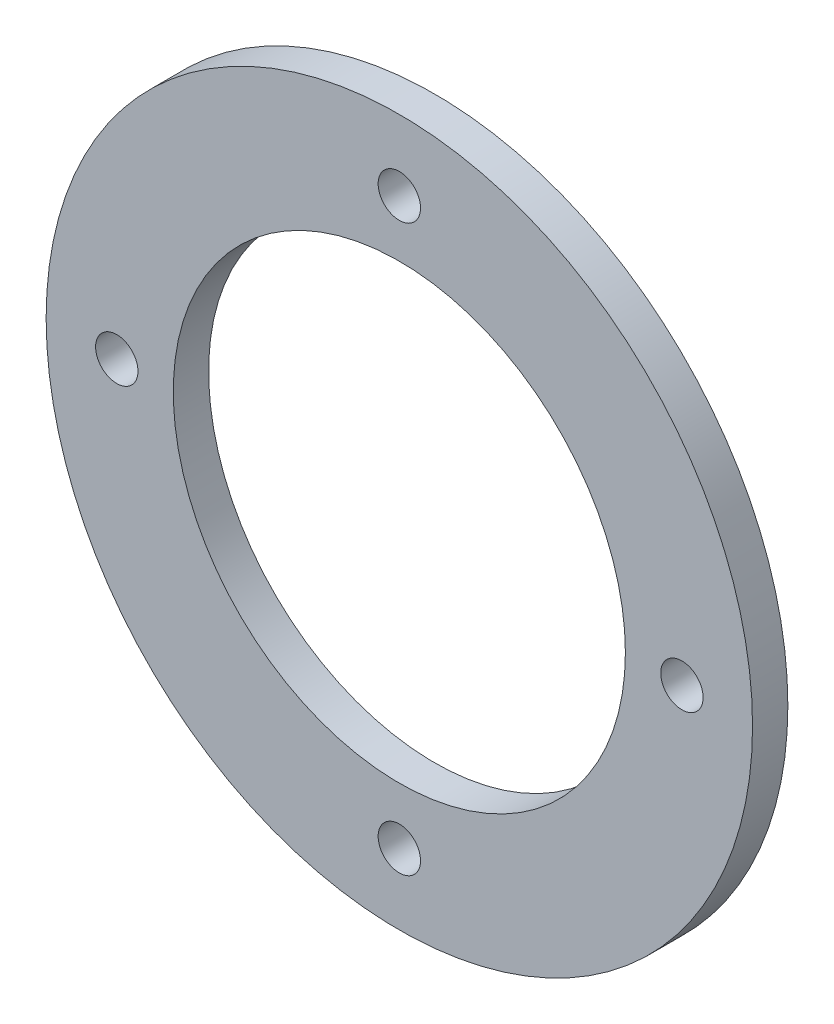
ISO-10303-21;
HEADER;
FILE_DESCRIPTION(('STEP AP214'),'2;1');
FILE_NAME('part.step','',(''),(''),'','','');
FILE_SCHEMA(('AUTOMOTIVE_DESIGN { 1 0 10303 214 1 1 1 1 }'));
ENDSEC;
DATA;
#1=APPLICATION_CONTEXT('core data for automotive mechanical design processes');
#2=APPLICATION_PROTOCOL_DEFINITION('international standard','automotive_design',2000,#1);
#3=PRODUCT_CONTEXT('',#1,'mechanical');
#4=PRODUCT('Part','Part','',(#3));
#5=PRODUCT_RELATED_PRODUCT_CATEGORY('part','',(#4));
#6=PRODUCT_DEFINITION_FORMATION('','',#4);
#7=PRODUCT_DEFINITION_CONTEXT('part definition',#1,'design');
#8=PRODUCT_DEFINITION('design','',#6,#7);
#9=PRODUCT_DEFINITION_SHAPE('','',#8);
#10=(LENGTH_UNIT() NAMED_UNIT(*) SI_UNIT(.MILLI.,.METRE.));
#11=(NAMED_UNIT(*) PLANE_ANGLE_UNIT() SI_UNIT($,.RADIAN.));
#12=(NAMED_UNIT(*) SI_UNIT($,.STERADIAN.) SOLID_ANGLE_UNIT());
#13=UNCERTAINTY_MEASURE_WITH_UNIT(LENGTH_MEASURE(1.E-05),#10,'distance_accuracy_value','');
#14=(GEOMETRIC_REPRESENTATION_CONTEXT(3) GLOBAL_UNCERTAINTY_ASSIGNED_CONTEXT((#13)) GLOBAL_UNIT_ASSIGNED_CONTEXT((#10,
#11,#12)) REPRESENTATION_CONTEXT('',''));
#15=CARTESIAN_POINT('',(0.,0.,0.));
#16=DIRECTION('',(0.,0.,1.));
#17=DIRECTION('',(1.,0.,0.));
#18=AXIS2_PLACEMENT_3D('',#15,#16,#17);
#19=CARTESIAN_POINT('',(0.,0.,5.));
#20=DIRECTION('',(0.,0.,-1.));
#21=DIRECTION('',(-1.,0.,0.));
#22=AXIS2_PLACEMENT_3D('',#19,#20,#21);
#23=CYLINDRICAL_SURFACE('',#22,50.);
#24=CARTESIAN_POINT('',(0.,0.,5.));
#25=DIRECTION('',(0.,0.,1.));
#26=DIRECTION('',(1.,0.,0.));
#27=AXIS2_PLACEMENT_3D('',#24,#25,#26);
#28=CIRCLE('',#27,50.);
#29=CARTESIAN_POINT('',(50.,0.,5.));
#30=VERTEX_POINT('',#29);
#31=EDGE_CURVE('E10',#30,#30,#28,.T.);
#32=ORIENTED_EDGE('',*,*,#31,.F.);
#33=EDGE_LOOP('',(#32));
#34=FACE_BOUND('',#33,.T.);
#35=CARTESIAN_POINT('',(0.,0.,0.));
#36=DIRECTION('',(0.,0.,1.));
#37=DIRECTION('',(1.,0.,0.));
#38=AXIS2_PLACEMENT_3D('',#35,#36,#37);
#39=CIRCLE('',#38,50.);
#40=CARTESIAN_POINT('',(50.,0.,0.));
#41=VERTEX_POINT('',#40);
#42=EDGE_CURVE('E40',#41,#41,#39,.T.);
#43=ORIENTED_EDGE('',*,*,#42,.T.);
#44=EDGE_LOOP('',(#43));
#45=FACE_BOUND('',#44,.T.);
#46=ADVANCED_FACE('F37',(#34,#45),#23,.T.);
#47=CARTESIAN_POINT('',(0.,0.,5.));
#48=DIRECTION('',(0.,0.,1.));
#49=DIRECTION('',(1.,0.,0.));
#50=AXIS2_PLACEMENT_3D('',#47,#48,#49);
#51=PLANE('',#50);
#52=CARTESIAN_POINT('',(0.,40.,5.));
#53=DIRECTION('',(0.,0.,1.));
#54=DIRECTION('',(1.,0.,0.));
#55=AXIS2_PLACEMENT_3D('',#52,#53,#54);
#56=CIRCLE('',#55,3.);
#57=CARTESIAN_POINT('',(3.,40.,5.));
#58=VERTEX_POINT('',#57);
#59=EDGE_CURVE('E83',#58,#58,#56,.T.);
#60=ORIENTED_EDGE('',*,*,#59,.F.);
#61=EDGE_LOOP('',(#60));
#62=FACE_BOUND('',#61,.T.);
#63=CARTESIAN_POINT('',(40.0000000000011,1.12952049642128E-12,5.));
#64=DIRECTION('',(0.,0.,1.));
#65=DIRECTION('',(1.,0.,0.));
#66=AXIS2_PLACEMENT_3D('',#63,#64,#65);
#67=CIRCLE('',#66,3.00000000000089);
#68=CARTESIAN_POINT('',(43.000000000002,1.12952049642128E-12,5.));
#69=VERTEX_POINT('',#68);
#70=EDGE_CURVE('E75',#69,#69,#67,.T.);
#71=ORIENTED_EDGE('',*,*,#70,.F.);
#72=EDGE_LOOP('',(#71));
#73=FACE_BOUND('',#72,.T.);
#74=CARTESIAN_POINT('',(2.25904099284255E-12,-40.,5.));
#75=DIRECTION('',(0.,0.,1.));
#76=DIRECTION('',(1.,0.,0.));
#77=AXIS2_PLACEMENT_3D('',#74,#75,#76);
#78=CIRCLE('',#77,3.00000000000243);
#79=CARTESIAN_POINT('',(3.00000000000469,-40.,5.));
#80=VERTEX_POINT('',#79);
#81=EDGE_CURVE('E67',#80,#80,#78,.T.);
#82=ORIENTED_EDGE('',*,*,#81,.F.);
#83=EDGE_LOOP('',(#82));
#84=FACE_BOUND('',#83,.T.);
#85=CARTESIAN_POINT('',(-39.9999999999989,-1.13441908361787E-12,5.));
#86=DIRECTION('',(0.,0.,1.));
#87=DIRECTION('',(1.,0.,0.));
#88=AXIS2_PLACEMENT_3D('',#85,#86,#87);
#89=CIRCLE('',#88,3.00000000000181);
#90=CARTESIAN_POINT('',(-36.9999999999971,-1.13441908361787E-12,5.));
#91=VERTEX_POINT('',#90);
#92=EDGE_CURVE('E59',#91,#91,#89,.T.);
#93=ORIENTED_EDGE('',*,*,#92,.F.);
#94=EDGE_LOOP('',(#93));
#95=FACE_BOUND('',#94,.T.);
#96=CARTESIAN_POINT('',(0.,0.,5.));
#97=DIRECTION('',(0.,0.,1.));
#98=DIRECTION('',(1.,0.,0.));
#99=AXIS2_PLACEMENT_3D('',#96,#97,#98);
#100=CIRCLE('',#99,32.);
#101=CARTESIAN_POINT('',(32.,0.,5.));
#102=VERTEX_POINT('',#101);
#103=EDGE_CURVE('E51',#102,#102,#100,.T.);
#104=ORIENTED_EDGE('',*,*,#103,.F.);
#105=EDGE_LOOP('',(#104));
#106=FACE_BOUND('',#105,.T.);
#107=ORIENTED_EDGE('',*,*,#31,.T.);
#108=EDGE_LOOP('',(#107));
#109=FACE_BOUND('',#108,.T.);
#110=ADVANCED_FACE('F101',(#62,#73,#84,#95,#106,#109),#51,.T.);
#111=CARTESIAN_POINT('',(0.,0.,0.));
#112=DIRECTION('',(0.,0.,1.));
#113=DIRECTION('',(1.,0.,0.));
#114=AXIS2_PLACEMENT_3D('',#111,#112,#113);
#115=PLANE('',#114);
#116=CARTESIAN_POINT('',(0.,40.,0.));
#117=DIRECTION('',(0.,0.,1.));
#118=DIRECTION('',(1.,0.,0.));
#119=AXIS2_PLACEMENT_3D('',#116,#117,#118);
#120=CIRCLE('',#119,3.);
#121=CARTESIAN_POINT('',(3.,40.,0.));
#122=VERTEX_POINT('',#121);
#123=EDGE_CURVE('E55',#122,#122,#120,.T.);
#124=ORIENTED_EDGE('',*,*,#123,.T.);
#125=EDGE_LOOP('',(#124));
#126=FACE_BOUND('',#125,.T.);
#127=CARTESIAN_POINT('',(40.0000000000011,1.12952049642128E-12,0.));
#128=DIRECTION('',(0.,0.,1.));
#129=DIRECTION('',(1.,0.,0.));
#130=AXIS2_PLACEMENT_3D('',#127,#128,#129);
#131=CIRCLE('',#130,3.00000000000089);
#132=CARTESIAN_POINT('',(43.000000000002,1.12952049642128E-12,0.));
#133=VERTEX_POINT('',#132);
#134=EDGE_CURVE('E79',#133,#133,#131,.T.);
#135=ORIENTED_EDGE('',*,*,#134,.T.);
#136=EDGE_LOOP('',(#135));
#137=FACE_BOUND('',#136,.T.);
#138=CARTESIAN_POINT('',(2.25904099284255E-12,-40.,0.));
#139=DIRECTION('',(0.,0.,1.));
#140=DIRECTION('',(1.,0.,0.));
#141=AXIS2_PLACEMENT_3D('',#138,#139,#140);
#142=CIRCLE('',#141,3.00000000000243);
#143=CARTESIAN_POINT('',(3.00000000000469,-40.,0.));
#144=VERTEX_POINT('',#143);
#145=EDGE_CURVE('E71',#144,#144,#142,.T.);
#146=ORIENTED_EDGE('',*,*,#145,.T.);
#147=EDGE_LOOP('',(#146));
#148=FACE_BOUND('',#147,.T.);
#149=CARTESIAN_POINT('',(-39.9999999999989,-1.13441908361787E-12,0.));
#150=DIRECTION('',(0.,0.,1.));
#151=DIRECTION('',(1.,0.,0.));
#152=AXIS2_PLACEMENT_3D('',#149,#150,#151);
#153=CIRCLE('',#152,3.00000000000181);
#154=CARTESIAN_POINT('',(-36.9999999999971,-1.13441908361787E-12,0.));
#155=VERTEX_POINT('',#154);
#156=EDGE_CURVE('E63',#155,#155,#153,.T.);
#157=ORIENTED_EDGE('',*,*,#156,.T.);
#158=EDGE_LOOP('',(#157));
#159=FACE_BOUND('',#158,.T.);
#160=CARTESIAN_POINT('',(0.,0.,0.));
#161=DIRECTION('',(0.,0.,1.));
#162=DIRECTION('',(1.,0.,0.));
#163=AXIS2_PLACEMENT_3D('',#160,#161,#162);
#164=CIRCLE('',#163,32.);
#165=CARTESIAN_POINT('',(32.,0.,0.));
#166=VERTEX_POINT('',#165);
#167=EDGE_CURVE('E49',#166,#166,#164,.T.);
#168=ORIENTED_EDGE('',*,*,#167,.T.);
#169=EDGE_LOOP('',(#168));
#170=FACE_BOUND('',#169,.T.);
#171=ORIENTED_EDGE('',*,*,#42,.F.);
#172=EDGE_LOOP('',(#171));
#173=FACE_BOUND('',#172,.T.);
#174=ADVANCED_FACE('F91',(#126,#137,#148,#159,#170,#173),#115,.F.);
#175=CARTESIAN_POINT('',(0.,0.,0.));
#176=DIRECTION('',(0.,0.,1.));
#177=DIRECTION('',(1.,0.,0.));
#178=AXIS2_PLACEMENT_3D('',#175,#176,#177);
#179=CYLINDRICAL_SURFACE('',#178,32.);
#180=ORIENTED_EDGE('',*,*,#167,.F.);
#181=EDGE_LOOP('',(#180));
#182=FACE_BOUND('',#181,.T.);
#183=ORIENTED_EDGE('',*,*,#103,.T.);
#184=EDGE_LOOP('',(#183));
#185=FACE_BOUND('',#184,.T.);
#186=ADVANCED_FACE('F113',(#182,#185),#179,.F.);
#187=CARTESIAN_POINT('',(-39.9999999999989,-1.13441908361787E-12,0.));
#188=DIRECTION('',(0.,0.,1.));
#189=DIRECTION('',(1.,0.,0.));
#190=AXIS2_PLACEMENT_3D('',#187,#188,#189);
#191=CYLINDRICAL_SURFACE('',#190,3.00000000000181);
#192=ORIENTED_EDGE('',*,*,#156,.F.);
#193=EDGE_LOOP('',(#192));
#194=FACE_BOUND('',#193,.T.);
#195=ORIENTED_EDGE('',*,*,#92,.T.);
#196=EDGE_LOOP('',(#195));
#197=FACE_BOUND('',#196,.T.);
#198=ADVANCED_FACE('F115',(#194,#197),#191,.F.);
#199=CARTESIAN_POINT('',(2.25904099284255E-12,-40.,0.));
#200=DIRECTION('',(0.,0.,1.));
#201=DIRECTION('',(1.,0.,0.));
#202=AXIS2_PLACEMENT_3D('',#199,#200,#201);
#203=CYLINDRICAL_SURFACE('',#202,3.00000000000243);
#204=ORIENTED_EDGE('',*,*,#145,.F.);
#205=EDGE_LOOP('',(#204));
#206=FACE_BOUND('',#205,.T.);
#207=ORIENTED_EDGE('',*,*,#81,.T.);
#208=EDGE_LOOP('',(#207));
#209=FACE_BOUND('',#208,.T.);
#210=ADVANCED_FACE('F122',(#206,#209),#203,.F.);
#211=CARTESIAN_POINT('',(40.0000000000011,1.12952049642128E-12,0.));
#212=DIRECTION('',(0.,0.,1.));
#213=DIRECTION('',(1.,0.,0.));
#214=AXIS2_PLACEMENT_3D('',#211,#212,#213);
#215=CYLINDRICAL_SURFACE('',#214,3.00000000000089);
#216=ORIENTED_EDGE('',*,*,#134,.F.);
#217=EDGE_LOOP('',(#216));
#218=FACE_BOUND('',#217,.T.);
#219=ORIENTED_EDGE('',*,*,#70,.T.);
#220=EDGE_LOOP('',(#219));
#221=FACE_BOUND('',#220,.T.);
#222=ADVANCED_FACE('F97',(#218,#221),#215,.F.);
#223=CARTESIAN_POINT('',(0.,40.,0.));
#224=DIRECTION('',(0.,0.,1.));
#225=DIRECTION('',(1.,0.,0.));
#226=AXIS2_PLACEMENT_3D('',#223,#224,#225);
#227=CYLINDRICAL_SURFACE('',#226,3.);
#228=ORIENTED_EDGE('',*,*,#123,.F.);
#229=EDGE_LOOP('',(#228));
#230=FACE_BOUND('',#229,.T.);
#231=ORIENTED_EDGE('',*,*,#59,.T.);
#232=EDGE_LOOP('',(#231));
#233=FACE_BOUND('',#232,.T.);
#234=ADVANCED_FACE('F94',(#230,#233),#227,.F.);
#235=CLOSED_SHELL('',(#46,#110,#174,#186,#198,#210,#222,#234));
#236=MANIFOLD_SOLID_BREP('B2',#235);
#237=ADVANCED_BREP_SHAPE_REPRESENTATION('',(#18,#236),#14);
#238=SHAPE_DEFINITION_REPRESENTATION(#9,#237);
ENDSEC;
END-ISO-10303-21;
